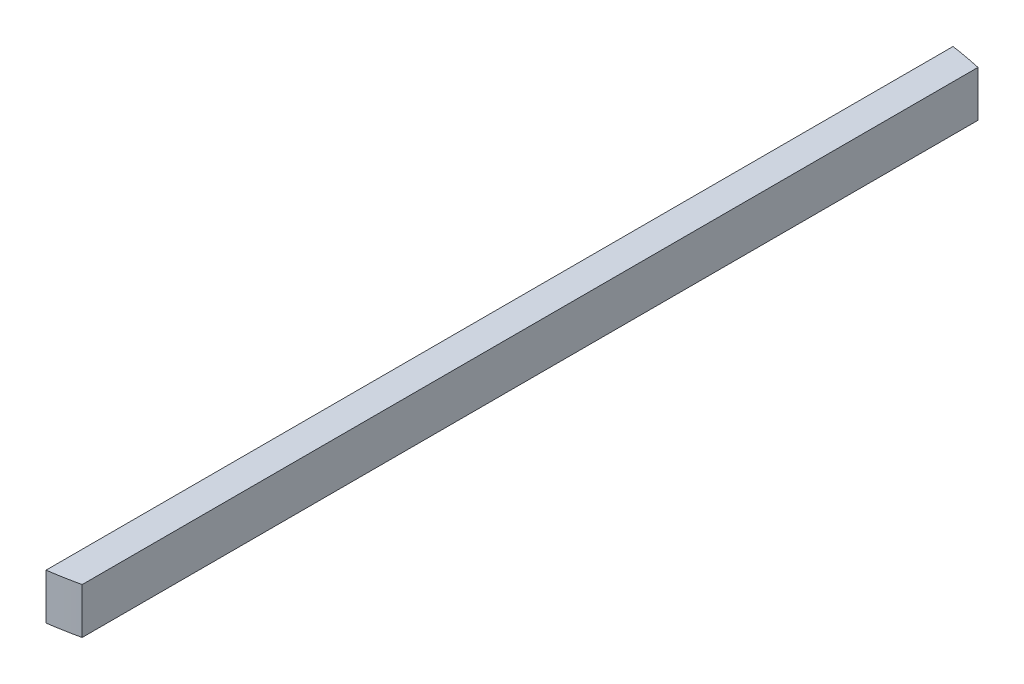
ISO-10303-21;
HEADER;
FILE_DESCRIPTION(('STEP AP214'),'2;1');
FILE_NAME('part.step','',(''),(''),'','','');
FILE_SCHEMA(('AUTOMOTIVE_DESIGN { 1 0 10303 214 1 1 1 1 }'));
ENDSEC;
DATA;
#1=APPLICATION_CONTEXT('core data for automotive mechanical design processes');
#2=APPLICATION_PROTOCOL_DEFINITION('international standard','automotive_design',2000,#1);
#3=PRODUCT_CONTEXT('',#1,'mechanical');
#4=PRODUCT('Part','Part','',(#3));
#5=PRODUCT_RELATED_PRODUCT_CATEGORY('part','',(#4));
#6=PRODUCT_DEFINITION_FORMATION('','',#4);
#7=PRODUCT_DEFINITION_CONTEXT('part definition',#1,'design');
#8=PRODUCT_DEFINITION('design','',#6,#7);
#9=PRODUCT_DEFINITION_SHAPE('','',#8);
#10=(LENGTH_UNIT() NAMED_UNIT(*) SI_UNIT(.MILLI.,.METRE.));
#11=(NAMED_UNIT(*) PLANE_ANGLE_UNIT() SI_UNIT($,.RADIAN.));
#12=(NAMED_UNIT(*) SI_UNIT($,.STERADIAN.) SOLID_ANGLE_UNIT());
#13=UNCERTAINTY_MEASURE_WITH_UNIT(LENGTH_MEASURE(1.E-05),#10,'distance_accuracy_value','');
#14=(GEOMETRIC_REPRESENTATION_CONTEXT(3) GLOBAL_UNCERTAINTY_ASSIGNED_CONTEXT((#13)) GLOBAL_UNIT_ASSIGNED_CONTEXT((#10,
#11,#12)) REPRESENTATION_CONTEXT('',''));
#15=CARTESIAN_POINT('',(0.,0.,0.));
#16=DIRECTION('',(0.,0.,1.));
#17=DIRECTION('',(1.,0.,0.));
#18=AXIS2_PLACEMENT_3D('',#15,#16,#17);
#19=CARTESIAN_POINT('',(0.,4.7625,0.));
#20=DIRECTION('',(0.,-1.,0.));
#21=DIRECTION('',(0.,0.,-1.));
#22=AXIS2_PLACEMENT_3D('',#19,#20,#21);
#23=CYLINDRICAL_SURFACE('',#22,47.625);
#24=CARTESIAN_POINT('',(0.,0.,0.));
#25=DIRECTION('',(0.,1.,0.));
#26=DIRECTION('',(0.,0.,1.));
#27=AXIS2_PLACEMENT_3D('',#24,#25,#26);
#28=CIRCLE('',#27,47.625);
#29=CARTESIAN_POINT('',(10.16,0.,-46.5286473583748));
#30=VERTEX_POINT('',#29);
#31=CARTESIAN_POINT('',(6.98500000000004,0.,-47.1099819571182));
#32=VERTEX_POINT('',#31);
#33=EDGE_CURVE('E95',#30,#32,#28,.T.);
#34=ORIENTED_EDGE('',*,*,#33,.T.);
#35=DIRECTION('',(0.,-1.,0.));
#36=VECTOR('',#35,1.);
#37=CARTESIAN_POINT('',(6.98500000000004,4.7625,-47.1099819571182));
#38=LINE('',#37,#36);
#39=CARTESIAN_POINT('',(6.98500000000004,4.7625,-47.1099819571182));
#40=VERTEX_POINT('',#39);
#41=EDGE_CURVE('E11',#40,#32,#38,.T.);
#42=ORIENTED_EDGE('',*,*,#41,.F.);
#43=CARTESIAN_POINT('',(0.,4.7625,0.));
#44=DIRECTION('',(0.,1.,0.));
#45=DIRECTION('',(0.,0.,1.));
#46=AXIS2_PLACEMENT_3D('',#43,#44,#45);
#47=CIRCLE('',#46,47.625);
#48=CARTESIAN_POINT('',(10.16,4.7625,-46.5286473583748));
#49=VERTEX_POINT('',#48);
#50=EDGE_CURVE('E83',#49,#40,#47,.T.);
#51=ORIENTED_EDGE('',*,*,#50,.F.);
#52=DIRECTION('',(0.,-1.,0.));
#53=VECTOR('',#52,1.);
#54=CARTESIAN_POINT('',(10.16,4.7625,-46.5286473583748));
#55=LINE('',#54,#53);
#56=EDGE_CURVE('E91',#49,#30,#55,.T.);
#57=ORIENTED_EDGE('',*,*,#56,.T.);
#58=EDGE_LOOP('',(#34,#42,#51,#57));
#59=FACE_BOUND('',#58,.T.);
#60=ADVANCED_FACE('F32',(#59),#23,.T.);
#61=CARTESIAN_POINT('',(6.98500000000004,4.7625,-47.1099819571182));
#62=DIRECTION('',(1.,0.,0.));
#63=DIRECTION('',(0.,0.,-1.));
#64=AXIS2_PLACEMENT_3D('',#61,#62,#63);
#65=PLANE('',#64);
#66=DIRECTION('',(0.,0.,1.));
#67=VECTOR('',#66,1.);
#68=CARTESIAN_POINT('',(6.98500000000004,0.,-47.1099819571182));
#69=LINE('',#68,#67);
#70=CARTESIAN_POINT('',(6.98500000000004,0.,47.1099819571182));
#71=VERTEX_POINT('',#70);
#72=EDGE_CURVE('E87',#32,#71,#69,.T.);
#73=ORIENTED_EDGE('',*,*,#72,.T.);
#74=DIRECTION('',(0.,-1.,0.));
#75=VECTOR('',#74,1.);
#76=CARTESIAN_POINT('',(6.98500000000004,4.7625,47.1099819571182));
#77=LINE('',#76,#75);
#78=CARTESIAN_POINT('',(6.98500000000004,4.7625,47.1099819571182));
#79=VERTEX_POINT('',#78);
#80=EDGE_CURVE('E40',#79,#71,#77,.T.);
#81=ORIENTED_EDGE('',*,*,#80,.F.);
#82=DIRECTION('',(0.,0.,1.));
#83=VECTOR('',#82,1.);
#84=CARTESIAN_POINT('',(6.98500000000004,4.7625,-47.1099819571182));
#85=LINE('',#84,#83);
#86=EDGE_CURVE('E78',#40,#79,#85,.T.);
#87=ORIENTED_EDGE('',*,*,#86,.F.);
#88=ORIENTED_EDGE('',*,*,#41,.T.);
#89=EDGE_LOOP('',(#73,#81,#87,#88));
#90=FACE_BOUND('',#89,.T.);
#91=ADVANCED_FACE('F86',(#90),#65,.F.);
#92=CARTESIAN_POINT('',(0.,4.7625,0.));
#93=DIRECTION('',(0.,-1.,0.));
#94=DIRECTION('',(0.,0.,-1.));
#95=AXIS2_PLACEMENT_3D('',#92,#93,#94);
#96=CYLINDRICAL_SURFACE('',#95,47.625);
#97=CARTESIAN_POINT('',(0.,0.,0.));
#98=DIRECTION('',(0.,1.,0.));
#99=DIRECTION('',(0.,0.,1.));
#100=AXIS2_PLACEMENT_3D('',#97,#98,#99);
#101=CIRCLE('',#100,47.625);
#102=CARTESIAN_POINT('',(10.16,0.,46.5286473583748));
#103=VERTEX_POINT('',#102);
#104=EDGE_CURVE('E65',#71,#103,#101,.T.);
#105=ORIENTED_EDGE('',*,*,#104,.T.);
#106=DIRECTION('',(0.,-1.,0.));
#107=VECTOR('',#106,1.);
#108=CARTESIAN_POINT('',(10.16,4.7625,46.5286473583748));
#109=LINE('',#108,#107);
#110=CARTESIAN_POINT('',(10.16,4.7625,46.5286473583748));
#111=VERTEX_POINT('',#110);
#112=EDGE_CURVE('E88',#111,#103,#109,.T.);
#113=ORIENTED_EDGE('',*,*,#112,.F.);
#114=CARTESIAN_POINT('',(0.,4.7625,0.));
#115=DIRECTION('',(0.,1.,0.));
#116=DIRECTION('',(0.,0.,1.));
#117=AXIS2_PLACEMENT_3D('',#114,#115,#116);
#118=CIRCLE('',#117,47.625);
#119=EDGE_CURVE('E81',#79,#111,#118,.T.);
#120=ORIENTED_EDGE('',*,*,#119,.F.);
#121=ORIENTED_EDGE('',*,*,#80,.T.);
#122=EDGE_LOOP('',(#105,#113,#120,#121));
#123=FACE_BOUND('',#122,.T.);
#124=ADVANCED_FACE('F89',(#123),#96,.T.);
#125=CARTESIAN_POINT('',(10.16,4.7625,46.5286473583748));
#126=DIRECTION('',(-1.,0.,0.));
#127=DIRECTION('',(0.,0.,1.));
#128=AXIS2_PLACEMENT_3D('',#125,#126,#127);
#129=PLANE('',#128);
#130=DIRECTION('',(0.,0.,-1.));
#131=VECTOR('',#130,1.);
#132=CARTESIAN_POINT('',(10.16,0.,46.5286473583748));
#133=LINE('',#132,#131);
#134=EDGE_CURVE('E71',#103,#30,#133,.T.);
#135=ORIENTED_EDGE('',*,*,#134,.T.);
#136=ORIENTED_EDGE('',*,*,#56,.F.);
#137=DIRECTION('',(0.,0.,-1.));
#138=VECTOR('',#137,1.);
#139=CARTESIAN_POINT('',(10.16,4.7625,46.5286473583748));
#140=LINE('',#139,#138);
#141=EDGE_CURVE('E48',#111,#49,#140,.T.);
#142=ORIENTED_EDGE('',*,*,#141,.F.);
#143=ORIENTED_EDGE('',*,*,#112,.T.);
#144=EDGE_LOOP('',(#135,#136,#142,#143));
#145=FACE_BOUND('',#144,.T.);
#146=ADVANCED_FACE('F102',(#145),#129,.F.);
#147=CARTESIAN_POINT('',(0.,4.7625,0.));
#148=DIRECTION('',(0.,1.,0.));
#149=DIRECTION('',(0.,0.,1.));
#150=AXIS2_PLACEMENT_3D('',#147,#148,#149);
#151=PLANE('',#150);
#152=ORIENTED_EDGE('',*,*,#50,.T.);
#153=ORIENTED_EDGE('',*,*,#86,.T.);
#154=ORIENTED_EDGE('',*,*,#119,.T.);
#155=ORIENTED_EDGE('',*,*,#141,.T.);
#156=EDGE_LOOP('',(#152,#153,#154,#155));
#157=FACE_BOUND('',#156,.T.);
#158=ADVANCED_FACE('F79',(#157),#151,.T.);
#159=CARTESIAN_POINT('',(0.,0.,0.));
#160=DIRECTION('',(0.,1.,0.));
#161=DIRECTION('',(0.,0.,1.));
#162=AXIS2_PLACEMENT_3D('',#159,#160,#161);
#163=PLANE('',#162);
#164=ORIENTED_EDGE('',*,*,#33,.F.);
#165=ORIENTED_EDGE('',*,*,#134,.F.);
#166=ORIENTED_EDGE('',*,*,#104,.F.);
#167=ORIENTED_EDGE('',*,*,#72,.F.);
#168=EDGE_LOOP('',(#164,#165,#166,#167));
#169=FACE_BOUND('',#168,.T.);
#170=ADVANCED_FACE('F105',(#169),#163,.F.);
#171=CLOSED_SHELL('',(#60,#91,#124,#146,#158,#170));
#172=MANIFOLD_SOLID_BREP('B2',#171);
#173=ADVANCED_BREP_SHAPE_REPRESENTATION('',(#18,#172),#14);
#174=SHAPE_DEFINITION_REPRESENTATION(#9,#173);
ENDSEC;
END-ISO-10303-21;
